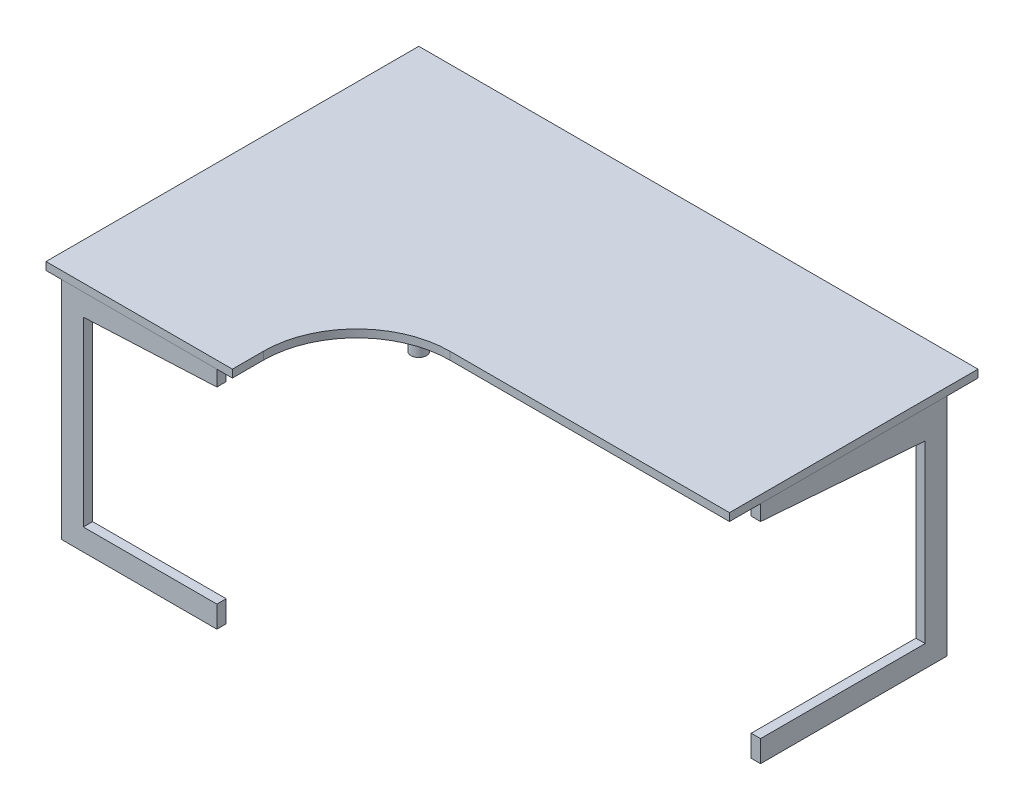
ISO-10303-21;
HEADER;
FILE_DESCRIPTION(('STEP AP214'),'2;1');
FILE_NAME('part.step','',(''),(''),'','','');
FILE_SCHEMA(('AUTOMOTIVE_DESIGN { 1 0 10303 214 1 1 1 1 }'));
ENDSEC;
DATA;
#1=APPLICATION_CONTEXT('core data for automotive mechanical design processes');
#2=APPLICATION_PROTOCOL_DEFINITION('international standard','automotive_design',2000,#1);
#3=PRODUCT_CONTEXT('',#1,'mechanical');
#4=PRODUCT('Part','Part','',(#3));
#5=PRODUCT_RELATED_PRODUCT_CATEGORY('part','',(#4));
#6=PRODUCT_DEFINITION_FORMATION('','',#4);
#7=PRODUCT_DEFINITION_CONTEXT('part definition',#1,'design');
#8=PRODUCT_DEFINITION('design','',#6,#7);
#9=PRODUCT_DEFINITION_SHAPE('','',#8);
#10=(LENGTH_UNIT() NAMED_UNIT(*) SI_UNIT(.MILLI.,.METRE.));
#11=(NAMED_UNIT(*) PLANE_ANGLE_UNIT() SI_UNIT($,.RADIAN.));
#12=(NAMED_UNIT(*) SI_UNIT($,.STERADIAN.) SOLID_ANGLE_UNIT());
#13=UNCERTAINTY_MEASURE_WITH_UNIT(LENGTH_MEASURE(1.E-05),#10,'distance_accuracy_value','');
#14=(GEOMETRIC_REPRESENTATION_CONTEXT(3) GLOBAL_UNCERTAINTY_ASSIGNED_CONTEXT((#13)) GLOBAL_UNIT_ASSIGNED_CONTEXT((#10,
#11,#12)) REPRESENTATION_CONTEXT('',''));
#15=CARTESIAN_POINT('',(0.,0.,0.));
#16=DIRECTION('',(0.,0.,1.));
#17=DIRECTION('',(1.,0.,0.));
#18=AXIS2_PLACEMENT_3D('',#15,#16,#17);
#19=CARTESIAN_POINT('',(-1250.,725.,1070.));
#20=DIRECTION('',(0.,1.,0.));
#21=DIRECTION('',(0.,0.,1.));
#22=AXIS2_PLACEMENT_3D('',#19,#20,#21);
#23=PLANE('',#22);
#24=DIRECTION('',(-1.,0.,0.));
#25=VECTOR('',#24,1.);
#26=CARTESIAN_POINT('',(-1250.,725.,1100.));
#27=LINE('',#26,#25);
#28=CARTESIAN_POINT('',(-1250.,725.,1100.));
#29=VERTEX_POINT('',#28);
#30=CARTESIAN_POINT('',(-1750.,725.,1100.));
#31=VERTEX_POINT('',#30);
#32=EDGE_CURVE('E142',#29,#31,#27,.T.);
#33=ORIENTED_EDGE('',*,*,#32,.F.);
#34=DIRECTION('',(0.,0.,1.));
#35=VECTOR('',#34,1.);
#36=CARTESIAN_POINT('',(-1250.,725.,1070.));
#37=LINE('',#36,#35);
#38=CARTESIAN_POINT('',(-1250.,725.,1070.));
#39=VERTEX_POINT('',#38);
#40=EDGE_CURVE('E12',#39,#29,#37,.T.);
#41=ORIENTED_EDGE('',*,*,#40,.F.);
#42=DIRECTION('',(-1.,0.,0.));
#43=VECTOR('',#42,1.);
#44=CARTESIAN_POINT('',(-1250.,725.,1070.));
#45=LINE('',#44,#43);
#46=CARTESIAN_POINT('',(-1750.,725.,1070.));
#47=VERTEX_POINT('',#46);
#48=EDGE_CURVE('E162',#39,#47,#45,.T.);
#49=ORIENTED_EDGE('',*,*,#48,.T.);
#50=DIRECTION('',(0.,0.,1.));
#51=VECTOR('',#50,1.);
#52=CARTESIAN_POINT('',(-1750.,725.,1070.));
#53=LINE('',#52,#51);
#54=EDGE_CURVE('E48',#47,#31,#53,.T.);
#55=ORIENTED_EDGE('',*,*,#54,.T.);
#56=EDGE_LOOP('',(#33,#41,#49,#55));
#57=FACE_BOUND('',#56,.T.);
#58=ADVANCED_FACE('F45',(#57),#23,.T.);
#59=CARTESIAN_POINT('',(-1250.,675.,1070.));
#60=DIRECTION('',(1.,0.,0.));
#61=DIRECTION('',(0.,1.,0.));
#62=AXIS2_PLACEMENT_3D('',#59,#60,#61);
#63=PLANE('',#62);
#64=DIRECTION('',(0.,1.,0.));
#65=VECTOR('',#64,1.);
#66=CARTESIAN_POINT('',(-1250.,675.,1100.));
#67=LINE('',#66,#65);
#68=CARTESIAN_POINT('',(-1250.,675.,1100.));
#69=VERTEX_POINT('',#68);
#70=EDGE_CURVE('E160',#69,#29,#67,.T.);
#71=ORIENTED_EDGE('',*,*,#70,.F.);
#72=DIRECTION('',(0.,0.,1.));
#73=VECTOR('',#72,1.);
#74=CARTESIAN_POINT('',(-1250.,675.,1070.));
#75=LINE('',#74,#73);
#76=CARTESIAN_POINT('',(-1250.,675.,1070.));
#77=VERTEX_POINT('',#76);
#78=EDGE_CURVE('E54',#77,#69,#75,.T.);
#79=ORIENTED_EDGE('',*,*,#78,.F.);
#80=DIRECTION('',(0.,1.,0.));
#81=VECTOR('',#80,1.);
#82=CARTESIAN_POINT('',(-1250.,675.,1070.));
#83=LINE('',#82,#81);
#84=EDGE_CURVE('E132',#77,#39,#83,.T.);
#85=ORIENTED_EDGE('',*,*,#84,.T.);
#86=ORIENTED_EDGE('',*,*,#40,.T.);
#87=EDGE_LOOP('',(#71,#79,#85,#86));
#88=FACE_BOUND('',#87,.T.);
#89=ADVANCED_FACE('F174',(#88),#63,.T.);
#90=CARTESIAN_POINT('',(-1680.,655.,1070.));
#91=DIRECTION('',(0.0464613993524679,-0.998920086078066,0.));
#92=DIRECTION('',(0.998920086078066,0.046461399352468,0.));
#93=AXIS2_PLACEMENT_3D('',#90,#91,#92);
#94=PLANE('',#93);
#95=DIRECTION('',(0.998920086078066,0.046461399352468,0.));
#96=VECTOR('',#95,1.);
#97=CARTESIAN_POINT('',(-1680.,655.,1100.));
#98=LINE('',#97,#96);
#99=CARTESIAN_POINT('',(-1680.,655.,1100.));
#100=VERTEX_POINT('',#99);
#101=EDGE_CURVE('E119',#100,#69,#98,.T.);
#102=ORIENTED_EDGE('',*,*,#101,.F.);
#103=DIRECTION('',(0.,0.,1.));
#104=VECTOR('',#103,1.);
#105=CARTESIAN_POINT('',(-1680.,655.,1070.));
#106=LINE('',#105,#104);
#107=CARTESIAN_POINT('',(-1680.,655.,1070.));
#108=VERTEX_POINT('',#107);
#109=EDGE_CURVE('E114',#108,#100,#106,.T.);
#110=ORIENTED_EDGE('',*,*,#109,.F.);
#111=DIRECTION('',(0.998920086078066,0.046461399352468,0.));
#112=VECTOR('',#111,1.);
#113=CARTESIAN_POINT('',(-1680.,655.,1070.));
#114=LINE('',#113,#112);
#115=EDGE_CURVE('E117',#108,#77,#114,.T.);
#116=ORIENTED_EDGE('',*,*,#115,.T.);
#117=ORIENTED_EDGE('',*,*,#78,.T.);
#118=EDGE_LOOP('',(#102,#110,#116,#117));
#119=FACE_BOUND('',#118,.T.);
#120=ADVANCED_FACE('F116',(#119),#94,.T.);
#121=CARTESIAN_POINT('',(-1680.,70.,1070.));
#122=DIRECTION('',(1.,0.,0.));
#123=DIRECTION('',(0.,1.,0.));
#124=AXIS2_PLACEMENT_3D('',#121,#122,#123);
#125=PLANE('',#124);
#126=DIRECTION('',(0.,1.,0.));
#127=VECTOR('',#126,1.);
#128=CARTESIAN_POINT('',(-1680.,70.,1100.));
#129=LINE('',#128,#127);
#130=CARTESIAN_POINT('',(-1680.,70.,1100.));
#131=VERTEX_POINT('',#130);
#132=EDGE_CURVE('E157',#131,#100,#129,.T.);
#133=ORIENTED_EDGE('',*,*,#132,.F.);
#134=DIRECTION('',(0.,0.,1.));
#135=VECTOR('',#134,1.);
#136=CARTESIAN_POINT('',(-1680.,70.,1070.));
#137=LINE('',#136,#135);
#138=CARTESIAN_POINT('',(-1680.,70.,1070.));
#139=VERTEX_POINT('',#138);
#140=EDGE_CURVE('E124',#139,#131,#137,.T.);
#141=ORIENTED_EDGE('',*,*,#140,.F.);
#142=DIRECTION('',(0.,1.,0.));
#143=VECTOR('',#142,1.);
#144=CARTESIAN_POINT('',(-1680.,70.,1070.));
#145=LINE('',#144,#143);
#146=EDGE_CURVE('E130',#139,#108,#145,.T.);
#147=ORIENTED_EDGE('',*,*,#146,.T.);
#148=ORIENTED_EDGE('',*,*,#109,.T.);
#149=EDGE_LOOP('',(#133,#141,#147,#148));
#150=FACE_BOUND('',#149,.T.);
#151=ADVANCED_FACE('F134',(#150),#125,.T.);
#152=CARTESIAN_POINT('',(-1250.,70.,1070.));
#153=DIRECTION('',(0.,1.,0.));
#154=DIRECTION('',(-1.,0.,0.));
#155=AXIS2_PLACEMENT_3D('',#152,#153,#154);
#156=PLANE('',#155);
#157=DIRECTION('',(-1.,0.,0.));
#158=VECTOR('',#157,1.);
#159=CARTESIAN_POINT('',(-1250.,70.,1100.));
#160=LINE('',#159,#158);
#161=CARTESIAN_POINT('',(-1250.,70.,1100.));
#162=VERTEX_POINT('',#161);
#163=EDGE_CURVE('E154',#162,#131,#160,.T.);
#164=ORIENTED_EDGE('',*,*,#163,.F.);
#165=DIRECTION('',(0.,0.,1.));
#166=VECTOR('',#165,1.);
#167=CARTESIAN_POINT('',(-1250.,70.,1070.));
#168=LINE('',#167,#166);
#169=CARTESIAN_POINT('',(-1250.,70.,1070.));
#170=VERTEX_POINT('',#169);
#171=EDGE_CURVE('E166',#170,#162,#168,.T.);
#172=ORIENTED_EDGE('',*,*,#171,.F.);
#173=DIRECTION('',(-1.,0.,0.));
#174=VECTOR('',#173,1.);
#175=CARTESIAN_POINT('',(-1250.,70.,1070.));
#176=LINE('',#175,#174);
#177=EDGE_CURVE('E135',#170,#139,#176,.T.);
#178=ORIENTED_EDGE('',*,*,#177,.T.);
#179=ORIENTED_EDGE('',*,*,#140,.T.);
#180=EDGE_LOOP('',(#164,#172,#178,#179));
#181=FACE_BOUND('',#180,.T.);
#182=ADVANCED_FACE('F187',(#181),#156,.T.);
#183=CARTESIAN_POINT('',(-1250.,0.,1070.));
#184=DIRECTION('',(1.,0.,0.));
#185=DIRECTION('',(0.,0.,-1.));
#186=AXIS2_PLACEMENT_3D('',#183,#184,#185);
#187=PLANE('',#186);
#188=DIRECTION('',(0.,1.,0.));
#189=VECTOR('',#188,1.);
#190=CARTESIAN_POINT('',(-1250.,0.,1100.));
#191=LINE('',#190,#189);
#192=CARTESIAN_POINT('',(-1250.,0.,1100.));
#193=VERTEX_POINT('',#192);
#194=EDGE_CURVE('E151',#193,#162,#191,.T.);
#195=ORIENTED_EDGE('',*,*,#194,.F.);
#196=DIRECTION('',(0.,0.,1.));
#197=VECTOR('',#196,1.);
#198=CARTESIAN_POINT('',(-1250.,0.,1070.));
#199=LINE('',#198,#197);
#200=CARTESIAN_POINT('',(-1250.,0.,1070.));
#201=VERTEX_POINT('',#200);
#202=EDGE_CURVE('E168',#201,#193,#199,.T.);
#203=ORIENTED_EDGE('',*,*,#202,.F.);
#204=DIRECTION('',(0.,1.,0.));
#205=VECTOR('',#204,1.);
#206=CARTESIAN_POINT('',(-1250.,0.,1070.));
#207=LINE('',#206,#205);
#208=EDGE_CURVE('E137',#201,#170,#207,.T.);
#209=ORIENTED_EDGE('',*,*,#208,.T.);
#210=ORIENTED_EDGE('',*,*,#171,.T.);
#211=EDGE_LOOP('',(#195,#203,#209,#210));
#212=FACE_BOUND('',#211,.T.);
#213=ADVANCED_FACE('F190',(#212),#187,.T.);
#214=CARTESIAN_POINT('',(-1750.,0.,1070.));
#215=DIRECTION('',(0.,-1.,0.));
#216=DIRECTION('',(1.,0.,0.));
#217=AXIS2_PLACEMENT_3D('',#214,#215,#216);
#218=PLANE('',#217);
#219=DIRECTION('',(1.,0.,0.));
#220=VECTOR('',#219,1.);
#221=CARTESIAN_POINT('',(-1750.,0.,1100.));
#222=LINE('',#221,#220);
#223=CARTESIAN_POINT('',(-1750.,0.,1100.));
#224=VERTEX_POINT('',#223);
#225=EDGE_CURVE('E148',#224,#193,#222,.T.);
#226=ORIENTED_EDGE('',*,*,#225,.F.);
#227=DIRECTION('',(0.,0.,1.));
#228=VECTOR('',#227,1.);
#229=CARTESIAN_POINT('',(-1750.,0.,1070.));
#230=LINE('',#229,#228);
#231=CARTESIAN_POINT('',(-1750.,0.,1070.));
#232=VERTEX_POINT('',#231);
#233=EDGE_CURVE('E169',#232,#224,#230,.T.);
#234=ORIENTED_EDGE('',*,*,#233,.F.);
#235=DIRECTION('',(1.,0.,0.));
#236=VECTOR('',#235,1.);
#237=CARTESIAN_POINT('',(-1750.,0.,1070.));
#238=LINE('',#237,#236);
#239=EDGE_CURVE('E265',#232,#201,#238,.T.);
#240=ORIENTED_EDGE('',*,*,#239,.T.);
#241=ORIENTED_EDGE('',*,*,#202,.T.);
#242=EDGE_LOOP('',(#226,#234,#240,#241));
#243=FACE_BOUND('',#242,.T.);
#244=ADVANCED_FACE('F194',(#243),#218,.T.);
#245=CARTESIAN_POINT('',(-1750.,725.,1070.));
#246=DIRECTION('',(-1.,0.,0.));
#247=DIRECTION('',(0.,-1.,0.));
#248=AXIS2_PLACEMENT_3D('',#245,#246,#247);
#249=PLANE('',#248);
#250=DIRECTION('',(0.,-1.,0.));
#251=VECTOR('',#250,1.);
#252=CARTESIAN_POINT('',(-1750.,725.,1100.));
#253=LINE('',#252,#251);
#254=EDGE_CURVE('E145',#31,#224,#253,.T.);
#255=ORIENTED_EDGE('',*,*,#254,.F.);
#256=ORIENTED_EDGE('',*,*,#54,.F.);
#257=DIRECTION('',(0.,-1.,0.));
#258=VECTOR('',#257,1.);
#259=CARTESIAN_POINT('',(-1750.,725.,1070.));
#260=LINE('',#259,#258);
#261=EDGE_CURVE('E266',#47,#232,#260,.T.);
#262=ORIENTED_EDGE('',*,*,#261,.T.);
#263=ORIENTED_EDGE('',*,*,#233,.T.);
#264=EDGE_LOOP('',(#255,#256,#262,#263));
#265=FACE_BOUND('',#264,.T.);
#266=ADVANCED_FACE('F171',(#265),#249,.T.);
#267=CARTESIAN_POINT('',(-1250.,725.,1070.));
#268=DIRECTION('',(0.,0.,-1.));
#269=DIRECTION('',(-1.,0.,0.));
#270=AXIS2_PLACEMENT_3D('',#267,#268,#269);
#271=PLANE('',#270);
#272=ORIENTED_EDGE('',*,*,#48,.F.);
#273=ORIENTED_EDGE('',*,*,#84,.F.);
#274=ORIENTED_EDGE('',*,*,#115,.F.);
#275=ORIENTED_EDGE('',*,*,#146,.F.);
#276=ORIENTED_EDGE('',*,*,#177,.F.);
#277=ORIENTED_EDGE('',*,*,#208,.F.);
#278=ORIENTED_EDGE('',*,*,#239,.F.);
#279=ORIENTED_EDGE('',*,*,#261,.F.);
#280=EDGE_LOOP('',(#272,#273,#274,#275,#276,#277,#278,#279));
#281=FACE_BOUND('',#280,.T.);
#282=ADVANCED_FACE('F128',(#281),#271,.T.);
#283=CARTESIAN_POINT('',(-1250.,725.,1100.));
#284=DIRECTION('',(0.,0.,-1.));
#285=DIRECTION('',(-1.,0.,0.));
#286=AXIS2_PLACEMENT_3D('',#283,#284,#285);
#287=PLANE('',#286);
#288=ORIENTED_EDGE('',*,*,#32,.T.);
#289=ORIENTED_EDGE('',*,*,#254,.T.);
#290=ORIENTED_EDGE('',*,*,#225,.T.);
#291=ORIENTED_EDGE('',*,*,#194,.T.);
#292=ORIENTED_EDGE('',*,*,#163,.T.);
#293=ORIENTED_EDGE('',*,*,#132,.T.);
#294=ORIENTED_EDGE('',*,*,#101,.T.);
#295=ORIENTED_EDGE('',*,*,#70,.T.);
#296=EDGE_LOOP('',(#288,#289,#290,#291,#292,#293,#294,#295));
#297=FACE_BOUND('',#296,.T.);
#298=ADVANCED_FACE('F173',(#297),#287,.F.);
#299=CLOSED_SHELL('',(#58,#89,#120,#151,#182,#213,#244,#266,#282,#298));
#300=MANIFOLD_SOLID_BREP('B2',#299);
#301=CARTESIAN_POINT('',(-900.,725.,1000.));
#302=DIRECTION('',(0.,1.,0.));
#303=DIRECTION('',(0.,0.,1.));
#304=AXIS2_PLACEMENT_3D('',#301,#302,#303);
#305=PLANE('',#304);
#306=DIRECTION('',(0.,0.,-1.));
#307=VECTOR('',#306,1.);
#308=CARTESIAN_POINT('',(0.,725.,-99.9999999999999));
#309=LINE('',#308,#307);
#310=CARTESIAN_POINT('',(0.,725.,700.));
#311=VERTEX_POINT('',#310);
#312=CARTESIAN_POINT('',(0.,725.,-99.9999999999999));
#313=VERTEX_POINT('',#312);
#314=EDGE_CURVE('E373',#311,#313,#309,.T.);
#315=ORIENTED_EDGE('',*,*,#314,.F.);
#316=DIRECTION('',(1.,0.,0.));
#317=VECTOR('',#316,1.);
#318=CARTESIAN_POINT('',(0.,725.,700.));
#319=LINE('',#318,#317);
#320=CARTESIAN_POINT('',(-900.,725.,700.));
#321=VERTEX_POINT('',#320);
#322=EDGE_CURVE('E330',#321,#311,#319,.T.);
#323=ORIENTED_EDGE('',*,*,#322,.F.);
#324=CARTESIAN_POINT('',(-900.,725.,1000.));
#325=DIRECTION('',(0.,-1.,0.));
#326=DIRECTION('',(0.,0.,1.));
#327=AXIS2_PLACEMENT_3D('',#324,#325,#326);
#328=CIRCLE('',#327,300.);
#329=CARTESIAN_POINT('',(-1200.,725.,1000.));
#330=VERTEX_POINT('',#329);
#331=EDGE_CURVE('E324',#330,#321,#328,.T.);
#332=ORIENTED_EDGE('',*,*,#331,.F.);
#333=DIRECTION('',(0.,0.,-1.));
#334=VECTOR('',#333,1.);
#335=CARTESIAN_POINT('',(-1200.,725.,1100.));
#336=LINE('',#335,#334);
#337=CARTESIAN_POINT('',(-1200.,725.,1100.));
#338=VERTEX_POINT('',#337);
#339=EDGE_CURVE('E363',#338,#330,#336,.T.);
#340=ORIENTED_EDGE('',*,*,#339,.F.);
#341=DIRECTION('',(1.,0.,0.));
#342=VECTOR('',#341,1.);
#343=CARTESIAN_POINT('',(-1800.,725.,1100.));
#344=LINE('',#343,#342);
#345=CARTESIAN_POINT('',(-1800.,725.,1100.));
#346=VERTEX_POINT('',#345);
#347=EDGE_CURVE('E381',#346,#338,#344,.T.);
#348=ORIENTED_EDGE('',*,*,#347,.F.);
#349=DIRECTION('',(0.,0.,1.));
#350=VECTOR('',#349,1.);
#351=CARTESIAN_POINT('',(-1800.,725.,-99.9999999999999));
#352=LINE('',#351,#350);
#353=CARTESIAN_POINT('',(-1800.,725.,-99.9999999999999));
#354=VERTEX_POINT('',#353);
#355=EDGE_CURVE('E379',#354,#346,#352,.T.);
#356=ORIENTED_EDGE('',*,*,#355,.F.);
#357=DIRECTION('',(-1.,0.,0.));
#358=VECTOR('',#357,1.);
#359=CARTESIAN_POINT('',(0.,725.,-99.9999999999999));
#360=LINE('',#359,#358);
#361=EDGE_CURVE('E376',#313,#354,#360,.T.);
#362=ORIENTED_EDGE('',*,*,#361,.F.);
#363=EDGE_LOOP('',(#315,#323,#332,#340,#348,#356,#362));
#364=FACE_BOUND('',#363,.T.);
#365=CARTESIAN_POINT('',(-1700.,725.,0.));
#366=DIRECTION('',(0.,1.,0.));
#367=DIRECTION('',(0.,0.,1.));
#368=AXIS2_PLACEMENT_3D('',#365,#366,#367);
#369=CIRCLE('',#368,25.);
#370=CARTESIAN_POINT('',(-1700.,725.,25.));
#371=VERTEX_POINT('',#370);
#372=EDGE_CURVE('E43',#371,#371,#369,.F.);
#373=ORIENTED_EDGE('',*,*,#372,.F.);
#374=EDGE_LOOP('',(#373));
#375=FACE_BOUND('',#374,.T.);
#376=ADVANCED_FACE('F281',(#364,#375),#305,.F.);
#377=CARTESIAN_POINT('',(0.,750.,-99.9999999999999));
#378=DIRECTION('',(-1.,0.,0.));
#379=DIRECTION('',(0.,0.,1.));
#380=AXIS2_PLACEMENT_3D('',#377,#378,#379);
#381=PLANE('',#380);
#382=ORIENTED_EDGE('',*,*,#314,.T.);
#383=DIRECTION('',(0.,-1.,0.));
#384=VECTOR('',#383,1.);
#385=CARTESIAN_POINT('',(0.,750.,-99.9999999999999));
#386=LINE('',#385,#384);
#387=CARTESIAN_POINT('',(0.,750.,-99.9999999999999));
#388=VERTEX_POINT('',#387);
#389=EDGE_CURVE('E290',#388,#313,#386,.T.);
#390=ORIENTED_EDGE('',*,*,#389,.F.);
#391=DIRECTION('',(0.,0.,-1.));
#392=VECTOR('',#391,1.);
#393=CARTESIAN_POINT('',(0.,750.,-99.9999999999999));
#394=LINE('',#393,#392);
#395=CARTESIAN_POINT('',(0.,750.,700.));
#396=VERTEX_POINT('',#395);
#397=EDGE_CURVE('E386',#396,#388,#394,.T.);
#398=ORIENTED_EDGE('',*,*,#397,.F.);
#399=DIRECTION('',(0.,-1.,0.));
#400=VECTOR('',#399,1.);
#401=CARTESIAN_POINT('',(0.,750.,700.));
#402=LINE('',#401,#400);
#403=EDGE_CURVE('E369',#396,#311,#402,.T.);
#404=ORIENTED_EDGE('',*,*,#403,.T.);
#405=EDGE_LOOP('',(#382,#390,#398,#404));
#406=FACE_BOUND('',#405,.T.);
#407=ADVANCED_FACE('F283',(#406),#381,.F.);
#408=CARTESIAN_POINT('',(0.,750.,-99.9999999999999));
#409=DIRECTION('',(0.,0.,1.));
#410=DIRECTION('',(1.,0.,0.));
#411=AXIS2_PLACEMENT_3D('',#408,#409,#410);
#412=PLANE('',#411);
#413=ORIENTED_EDGE('',*,*,#361,.T.);
#414=DIRECTION('',(0.,-1.,0.));
#415=VECTOR('',#414,1.);
#416=CARTESIAN_POINT('',(-1800.,750.,-99.9999999999999));
#417=LINE('',#416,#415);
#418=CARTESIAN_POINT('',(-1800.,750.,-99.9999999999999));
#419=VERTEX_POINT('',#418);
#420=EDGE_CURVE('E393',#419,#354,#417,.T.);
#421=ORIENTED_EDGE('',*,*,#420,.F.);
#422=DIRECTION('',(-1.,0.,0.));
#423=VECTOR('',#422,1.);
#424=CARTESIAN_POINT('',(0.,750.,-99.9999999999999));
#425=LINE('',#424,#423);
#426=EDGE_CURVE('E339',#388,#419,#425,.T.);
#427=ORIENTED_EDGE('',*,*,#426,.F.);
#428=ORIENTED_EDGE('',*,*,#389,.T.);
#429=EDGE_LOOP('',(#413,#421,#427,#428));
#430=FACE_BOUND('',#429,.T.);
#431=ADVANCED_FACE('F396',(#430),#412,.F.);
#432=CARTESIAN_POINT('',(-1800.,750.,-99.9999999999999));
#433=DIRECTION('',(1.,0.,0.));
#434=DIRECTION('',(0.,0.,-1.));
#435=AXIS2_PLACEMENT_3D('',#432,#433,#434);
#436=PLANE('',#435);
#437=ORIENTED_EDGE('',*,*,#355,.T.);
#438=DIRECTION('',(0.,-1.,0.));
#439=VECTOR('',#438,1.);
#440=CARTESIAN_POINT('',(-1800.,750.,1100.));
#441=LINE('',#440,#439);
#442=CARTESIAN_POINT('',(-1800.,750.,1100.));
#443=VERTEX_POINT('',#442);
#444=EDGE_CURVE('E390',#443,#346,#441,.T.);
#445=ORIENTED_EDGE('',*,*,#444,.F.);
#446=DIRECTION('',(0.,0.,1.));
#447=VECTOR('',#446,1.);
#448=CARTESIAN_POINT('',(-1800.,750.,-99.9999999999999));
#449=LINE('',#448,#447);
#450=EDGE_CURVE('E410',#419,#443,#449,.T.);
#451=ORIENTED_EDGE('',*,*,#450,.F.);
#452=ORIENTED_EDGE('',*,*,#420,.T.);
#453=EDGE_LOOP('',(#437,#445,#451,#452));
#454=FACE_BOUND('',#453,.T.);
#455=ADVANCED_FACE('F406',(#454),#436,.F.);
#456=CARTESIAN_POINT('',(-1800.,750.,1100.));
#457=DIRECTION('',(0.,0.,-1.));
#458=DIRECTION('',(-1.,0.,0.));
#459=AXIS2_PLACEMENT_3D('',#456,#457,#458);
#460=PLANE('',#459);
#461=ORIENTED_EDGE('',*,*,#347,.T.);
#462=DIRECTION('',(0.,-1.,0.));
#463=VECTOR('',#462,1.);
#464=CARTESIAN_POINT('',(-1200.,750.,1100.));
#465=LINE('',#464,#463);
#466=CARTESIAN_POINT('',(-1200.,750.,1100.));
#467=VERTEX_POINT('',#466);
#468=EDGE_CURVE('E364',#467,#338,#465,.T.);
#469=ORIENTED_EDGE('',*,*,#468,.F.);
#470=DIRECTION('',(1.,0.,0.));
#471=VECTOR('',#470,1.);
#472=CARTESIAN_POINT('',(-1800.,750.,1100.));
#473=LINE('',#472,#471);
#474=EDGE_CURVE('E355',#443,#467,#473,.T.);
#475=ORIENTED_EDGE('',*,*,#474,.F.);
#476=ORIENTED_EDGE('',*,*,#444,.T.);
#477=EDGE_LOOP('',(#461,#469,#475,#476));
#478=FACE_BOUND('',#477,.T.);
#479=ADVANCED_FACE('F409',(#478),#460,.F.);
#480=CARTESIAN_POINT('',(-1200.,750.,1100.));
#481=DIRECTION('',(-1.,0.,0.));
#482=DIRECTION('',(0.,0.,1.));
#483=AXIS2_PLACEMENT_3D('',#480,#481,#482);
#484=PLANE('',#483);
#485=ORIENTED_EDGE('',*,*,#339,.T.);
#486=DIRECTION('',(0.,-1.,0.));
#487=VECTOR('',#486,1.);
#488=CARTESIAN_POINT('',(-1200.,750.,1000.));
#489=LINE('',#488,#487);
#490=CARTESIAN_POINT('',(-1200.,750.,1000.));
#491=VERTEX_POINT('',#490);
#492=EDGE_CURVE('E360',#491,#330,#489,.T.);
#493=ORIENTED_EDGE('',*,*,#492,.F.);
#494=DIRECTION('',(0.,0.,-1.));
#495=VECTOR('',#494,1.);
#496=CARTESIAN_POINT('',(-1200.,750.,1100.));
#497=LINE('',#496,#495);
#498=EDGE_CURVE('E349',#467,#491,#497,.T.);
#499=ORIENTED_EDGE('',*,*,#498,.F.);
#500=ORIENTED_EDGE('',*,*,#468,.T.);
#501=EDGE_LOOP('',(#485,#493,#499,#500));
#502=FACE_BOUND('',#501,.T.);
#503=ADVANCED_FACE('F361',(#502),#484,.F.);
#504=CARTESIAN_POINT('',(-900.,750.,1000.));
#505=DIRECTION('',(0.,-1.,0.));
#506=DIRECTION('',(0.,0.,-1.));
#507=AXIS2_PLACEMENT_3D('',#504,#505,#506);
#508=CYLINDRICAL_SURFACE('',#507,300.);
#509=ORIENTED_EDGE('',*,*,#331,.T.);
#510=DIRECTION('',(0.,-1.,0.));
#511=VECTOR('',#510,1.);
#512=CARTESIAN_POINT('',(-900.,750.,700.));
#513=LINE('',#512,#511);
#514=CARTESIAN_POINT('',(-900.,750.,700.));
#515=VERTEX_POINT('',#514);
#516=EDGE_CURVE('E365',#515,#321,#513,.T.);
#517=ORIENTED_EDGE('',*,*,#516,.F.);
#518=CARTESIAN_POINT('',(-900.,750.,1000.));
#519=DIRECTION('',(0.,-1.,0.));
#520=DIRECTION('',(0.,0.,1.));
#521=AXIS2_PLACEMENT_3D('',#518,#519,#520);
#522=CIRCLE('',#521,300.);
#523=EDGE_CURVE('E353',#491,#515,#522,.T.);
#524=ORIENTED_EDGE('',*,*,#523,.F.);
#525=ORIENTED_EDGE('',*,*,#492,.T.);
#526=EDGE_LOOP('',(#509,#517,#524,#525));
#527=FACE_BOUND('',#526,.T.);
#528=ADVANCED_FACE('F367',(#527),#508,.F.);
#529=CARTESIAN_POINT('',(0.,750.,700.));
#530=DIRECTION('',(0.,0.,-1.));
#531=DIRECTION('',(-1.,0.,0.));
#532=AXIS2_PLACEMENT_3D('',#529,#530,#531);
#533=PLANE('',#532);
#534=ORIENTED_EDGE('',*,*,#322,.T.);
#535=ORIENTED_EDGE('',*,*,#403,.F.);
#536=DIRECTION('',(1.,0.,0.));
#537=VECTOR('',#536,1.);
#538=CARTESIAN_POINT('',(0.,750.,700.));
#539=LINE('',#538,#537);
#540=EDGE_CURVE('E298',#515,#396,#539,.T.);
#541=ORIENTED_EDGE('',*,*,#540,.F.);
#542=ORIENTED_EDGE('',*,*,#516,.T.);
#543=EDGE_LOOP('',(#534,#535,#541,#542));
#544=FACE_BOUND('',#543,.T.);
#545=ADVANCED_FACE('F435',(#544),#533,.F.);
#546=CARTESIAN_POINT('',(-900.,750.,1000.));
#547=DIRECTION('',(0.,1.,0.));
#548=DIRECTION('',(0.,0.,1.));
#549=AXIS2_PLACEMENT_3D('',#546,#547,#548);
#550=PLANE('',#549);
#551=ORIENTED_EDGE('',*,*,#397,.T.);
#552=ORIENTED_EDGE('',*,*,#426,.T.);
#553=ORIENTED_EDGE('',*,*,#450,.T.);
#554=ORIENTED_EDGE('',*,*,#474,.T.);
#555=ORIENTED_EDGE('',*,*,#498,.T.);
#556=ORIENTED_EDGE('',*,*,#523,.T.);
#557=ORIENTED_EDGE('',*,*,#540,.T.);
#558=EDGE_LOOP('',(#551,#552,#553,#554,#555,#556,#557));
#559=FACE_BOUND('',#558,.T.);
#560=ADVANCED_FACE('F351',(#559),#550,.T.);
#561=CARTESIAN_POINT('',(-1700.,795.710678118655,0.));
#562=DIRECTION('',(0.,-1.,0.));
#563=DIRECTION('',(0.,0.,-1.));
#564=AXIS2_PLACEMENT_3D('',#561,#562,#563);
#565=CYLINDRICAL_SURFACE('',#564,25.);
#566=CARTESIAN_POINT('',(-1700.,0.,0.));
#567=DIRECTION('',(0.,1.,0.));
#568=DIRECTION('',(0.,0.,1.));
#569=AXIS2_PLACEMENT_3D('',#566,#567,#568);
#570=CIRCLE('',#569,25.);
#571=CARTESIAN_POINT('',(-1700.,0.,25.));
#572=VERTEX_POINT('',#571);
#573=EDGE_CURVE('E377',#572,#572,#570,.T.);
#574=ORIENTED_EDGE('',*,*,#573,.T.);
#575=EDGE_LOOP('',(#574));
#576=FACE_BOUND('',#575,.T.);
#577=ORIENTED_EDGE('',*,*,#372,.T.);
#578=EDGE_LOOP('',(#577));
#579=FACE_BOUND('',#578,.T.);
#580=ADVANCED_FACE('F418',(#576,#579),#565,.T.);
#581=CARTESIAN_POINT('',(-1700.,0.,0.));
#582=DIRECTION('',(0.,1.,0.));
#583=DIRECTION('',(0.,0.,1.));
#584=AXIS2_PLACEMENT_3D('',#581,#582,#583);
#585=PLANE('',#584);
#586=ORIENTED_EDGE('',*,*,#573,.F.);
#587=EDGE_LOOP('',(#586));
#588=FACE_BOUND('',#587,.T.);
#589=ADVANCED_FACE('F421',(#588),#585,.F.);
#590=CLOSED_SHELL('',(#376,#407,#431,#455,#479,#503,#528,#545,#560,#580,#589));
#591=MANIFOLD_SOLID_BREP('B6',#590);
#592=CARTESIAN_POINT('',(-30.,725.,0.));
#593=DIRECTION('',(0.,0.,-1.));
#594=DIRECTION('',(0.,1.,0.));
#595=AXIS2_PLACEMENT_3D('',#592,#593,#594);
#596=PLANE('',#595);
#597=DIRECTION('',(0.,1.,0.));
#598=VECTOR('',#597,1.);
#599=CARTESIAN_POINT('',(0.,725.,0.));
#600=LINE('',#599,#598);
#601=CARTESIAN_POINT('',(0.,0.,0.));
#602=VERTEX_POINT('',#601);
#603=CARTESIAN_POINT('',(0.,725.,0.));
#604=VERTEX_POINT('',#603);
#605=EDGE_CURVE('E609',#602,#604,#600,.T.);
#606=ORIENTED_EDGE('',*,*,#605,.F.);
#607=DIRECTION('',(1.,0.,0.));
#608=VECTOR('',#607,1.);
#609=CARTESIAN_POINT('',(-30.,0.,0.));
#610=LINE('',#609,#608);
#611=CARTESIAN_POINT('',(-30.,0.,0.));
#612=VERTEX_POINT('',#611);
#613=EDGE_CURVE('E279',#612,#602,#610,.T.);
#614=ORIENTED_EDGE('',*,*,#613,.F.);
#615=DIRECTION('',(0.,1.,0.));
#616=VECTOR('',#615,1.);
#617=CARTESIAN_POINT('',(-30.,725.,0.));
#618=LINE('',#617,#616);
#619=CARTESIAN_POINT('',(-30.,725.,0.));
#620=VERTEX_POINT('',#619);
#621=EDGE_CURVE('E629',#612,#620,#618,.T.);
#622=ORIENTED_EDGE('',*,*,#621,.T.);
#623=DIRECTION('',(1.,0.,0.));
#624=VECTOR('',#623,1.);
#625=CARTESIAN_POINT('',(-30.,725.,0.));
#626=LINE('',#625,#624);
#627=EDGE_CURVE('E515',#620,#604,#626,.T.);
#628=ORIENTED_EDGE('',*,*,#627,.T.);
#629=EDGE_LOOP('',(#606,#614,#622,#628));
#630=FACE_BOUND('',#629,.T.);
#631=ADVANCED_FACE('F512',(#630),#596,.T.);
#632=CARTESIAN_POINT('',(-30.,0.,0.));
#633=DIRECTION('',(0.,-1.,0.));
#634=DIRECTION('',(0.,0.,-1.));
#635=AXIS2_PLACEMENT_3D('',#632,#633,#634);
#636=PLANE('',#635);
#637=DIRECTION('',(0.,0.,-1.));
#638=VECTOR('',#637,1.);
#639=CARTESIAN_POINT('',(0.,0.,0.));
#640=LINE('',#639,#638);
#641=CARTESIAN_POINT('',(0.,0.,600.));
#642=VERTEX_POINT('',#641);
#643=EDGE_CURVE('E627',#642,#602,#640,.T.);
#644=ORIENTED_EDGE('',*,*,#643,.F.);
#645=DIRECTION('',(1.,0.,0.));
#646=VECTOR('',#645,1.);
#647=CARTESIAN_POINT('',(-30.,0.,600.));
#648=LINE('',#647,#646);
#649=CARTESIAN_POINT('',(-30.,0.,600.));
#650=VERTEX_POINT('',#649);
#651=EDGE_CURVE('E521',#650,#642,#648,.T.);
#652=ORIENTED_EDGE('',*,*,#651,.F.);
#653=DIRECTION('',(0.,0.,-1.));
#654=VECTOR('',#653,1.);
#655=CARTESIAN_POINT('',(-30.,0.,0.));
#656=LINE('',#655,#654);
#657=EDGE_CURVE('E599',#650,#612,#656,.T.);
#658=ORIENTED_EDGE('',*,*,#657,.T.);
#659=ORIENTED_EDGE('',*,*,#613,.T.);
#660=EDGE_LOOP('',(#644,#652,#658,#659));
#661=FACE_BOUND('',#660,.T.);
#662=ADVANCED_FACE('F641',(#661),#636,.T.);
#663=CARTESIAN_POINT('',(-30.,0.,600.));
#664=DIRECTION('',(0.,0.,1.));
#665=DIRECTION('',(1.,0.,0.));
#666=AXIS2_PLACEMENT_3D('',#663,#664,#665);
#667=PLANE('',#666);
#668=DIRECTION('',(0.,-1.,0.));
#669=VECTOR('',#668,1.);
#670=CARTESIAN_POINT('',(0.,0.,600.));
#671=LINE('',#670,#669);
#672=CARTESIAN_POINT('',(0.,69.9999999999999,600.));
#673=VERTEX_POINT('',#672);
#674=EDGE_CURVE('E586',#673,#642,#671,.T.);
#675=ORIENTED_EDGE('',*,*,#674,.F.);
#676=DIRECTION('',(1.,0.,0.));
#677=VECTOR('',#676,1.);
#678=CARTESIAN_POINT('',(-30.,69.9999999999999,600.));
#679=LINE('',#678,#677);
#680=CARTESIAN_POINT('',(-30.,69.9999999999999,600.));
#681=VERTEX_POINT('',#680);
#682=EDGE_CURVE('E581',#681,#673,#679,.T.);
#683=ORIENTED_EDGE('',*,*,#682,.F.);
#684=DIRECTION('',(0.,-1.,0.));
#685=VECTOR('',#684,1.);
#686=CARTESIAN_POINT('',(-30.,0.,600.));
#687=LINE('',#686,#685);
#688=EDGE_CURVE('E584',#681,#650,#687,.T.);
#689=ORIENTED_EDGE('',*,*,#688,.T.);
#690=ORIENTED_EDGE('',*,*,#651,.T.);
#691=EDGE_LOOP('',(#675,#683,#689,#690));
#692=FACE_BOUND('',#691,.T.);
#693=ADVANCED_FACE('F583',(#692),#667,.T.);
#694=CARTESIAN_POINT('',(-30.,69.9999999999999,600.));
#695=DIRECTION('',(0.,1.,0.));
#696=DIRECTION('',(0.,0.,1.));
#697=AXIS2_PLACEMENT_3D('',#694,#695,#696);
#698=PLANE('',#697);
#699=DIRECTION('',(0.,0.,1.));
#700=VECTOR('',#699,1.);
#701=CARTESIAN_POINT('',(0.,69.9999999999999,600.));
#702=LINE('',#701,#700);
#703=CARTESIAN_POINT('',(0.,69.9999999999999,70.));
#704=VERTEX_POINT('',#703);
#705=EDGE_CURVE('E624',#704,#673,#702,.T.);
#706=ORIENTED_EDGE('',*,*,#705,.F.);
#707=DIRECTION('',(1.,0.,0.));
#708=VECTOR('',#707,1.);
#709=CARTESIAN_POINT('',(-30.,69.9999999999999,70.));
#710=LINE('',#709,#708);
#711=CARTESIAN_POINT('',(-30.,69.9999999999999,70.));
#712=VERTEX_POINT('',#711);
#713=EDGE_CURVE('E591',#712,#704,#710,.T.);
#714=ORIENTED_EDGE('',*,*,#713,.F.);
#715=DIRECTION('',(0.,0.,1.));
#716=VECTOR('',#715,1.);
#717=CARTESIAN_POINT('',(-30.,69.9999999999999,600.));
#718=LINE('',#717,#716);
#719=EDGE_CURVE('E597',#712,#681,#718,.T.);
#720=ORIENTED_EDGE('',*,*,#719,.T.);
#721=ORIENTED_EDGE('',*,*,#682,.T.);
#722=EDGE_LOOP('',(#706,#714,#720,#721));
#723=FACE_BOUND('',#722,.T.);
#724=ADVANCED_FACE('F601',(#723),#698,.T.);
#725=CARTESIAN_POINT('',(-30.,69.9999999999999,70.));
#726=DIRECTION('',(0.,0.,1.));
#727=DIRECTION('',(1.,0.,0.));
#728=AXIS2_PLACEMENT_3D('',#725,#726,#727);
#729=PLANE('',#728);
#730=DIRECTION('',(0.,-1.,0.));
#731=VECTOR('',#730,1.);
#732=CARTESIAN_POINT('',(0.,69.9999999999999,70.));
#733=LINE('',#732,#731);
#734=CARTESIAN_POINT('',(0.,635.,70.));
#735=VERTEX_POINT('',#734);
#736=EDGE_CURVE('E621',#735,#704,#733,.T.);
#737=ORIENTED_EDGE('',*,*,#736,.F.);
#738=DIRECTION('',(1.,0.,0.));
#739=VECTOR('',#738,1.);
#740=CARTESIAN_POINT('',(-30.,635.,70.));
#741=LINE('',#740,#739);
#742=CARTESIAN_POINT('',(-30.,635.,70.));
#743=VERTEX_POINT('',#742);
#744=EDGE_CURVE('E633',#743,#735,#741,.T.);
#745=ORIENTED_EDGE('',*,*,#744,.F.);
#746=DIRECTION('',(0.,-1.,0.));
#747=VECTOR('',#746,1.);
#748=CARTESIAN_POINT('',(-30.,69.9999999999999,70.));
#749=LINE('',#748,#747);
#750=EDGE_CURVE('E602',#743,#712,#749,.T.);
#751=ORIENTED_EDGE('',*,*,#750,.T.);
#752=ORIENTED_EDGE('',*,*,#713,.T.);
#753=EDGE_LOOP('',(#737,#745,#751,#752));
#754=FACE_BOUND('',#753,.T.);
#755=ADVANCED_FACE('F654',(#754),#729,.T.);
#756=CARTESIAN_POINT('',(-30.,635.,70.));
#757=DIRECTION('',(0.,-0.997164120486613,0.0752576694706876));
#758=DIRECTION('',(0.,-0.0752576694706876,-0.997164120486613));
#759=AXIS2_PLACEMENT_3D('',#756,#757,#758);
#760=PLANE('',#759);
#761=DIRECTION('',(0.,-0.0752576694706876,-0.997164120486613));
#762=VECTOR('',#761,1.);
#763=CARTESIAN_POINT('',(0.,635.,70.));
#764=LINE('',#763,#762);
#765=CARTESIAN_POINT('',(0.,675.,600.));
#766=VERTEX_POINT('',#765);
#767=EDGE_CURVE('E618',#766,#735,#764,.T.);
#768=ORIENTED_EDGE('',*,*,#767,.F.);
#769=DIRECTION('',(1.,0.,0.));
#770=VECTOR('',#769,1.);
#771=CARTESIAN_POINT('',(-30.,675.,600.));
#772=LINE('',#771,#770);
#773=CARTESIAN_POINT('',(-30.,675.,600.));
#774=VERTEX_POINT('',#773);
#775=EDGE_CURVE('E635',#774,#766,#772,.T.);
#776=ORIENTED_EDGE('',*,*,#775,.F.);
#777=DIRECTION('',(0.,-0.0752576694706876,-0.997164120486613));
#778=VECTOR('',#777,1.);
#779=CARTESIAN_POINT('',(-30.,635.,70.));
#780=LINE('',#779,#778);
#781=EDGE_CURVE('E604',#774,#743,#780,.T.);
#782=ORIENTED_EDGE('',*,*,#781,.T.);
#783=ORIENTED_EDGE('',*,*,#744,.T.);
#784=EDGE_LOOP('',(#768,#776,#782,#783));
#785=FACE_BOUND('',#784,.T.);
#786=ADVANCED_FACE('F657',(#785),#760,.T.);
#787=CARTESIAN_POINT('',(-30.,675.,600.));
#788=DIRECTION('',(0.,0.,1.));
#789=DIRECTION('',(1.,0.,0.));
#790=AXIS2_PLACEMENT_3D('',#787,#788,#789);
#791=PLANE('',#790);
#792=DIRECTION('',(0.,-1.,0.));
#793=VECTOR('',#792,1.);
#794=CARTESIAN_POINT('',(0.,675.,600.));
#795=LINE('',#794,#793);
#796=CARTESIAN_POINT('',(0.,725.,600.));
#797=VERTEX_POINT('',#796);
#798=EDGE_CURVE('E615',#797,#766,#795,.T.);
#799=ORIENTED_EDGE('',*,*,#798,.F.);
#800=DIRECTION('',(1.,0.,0.));
#801=VECTOR('',#800,1.);
#802=CARTESIAN_POINT('',(-30.,725.,600.));
#803=LINE('',#802,#801);
#804=CARTESIAN_POINT('',(-30.,725.,600.));
#805=VERTEX_POINT('',#804);
#806=EDGE_CURVE('E636',#805,#797,#803,.T.);
#807=ORIENTED_EDGE('',*,*,#806,.F.);
#808=DIRECTION('',(0.,-1.,0.));
#809=VECTOR('',#808,1.);
#810=CARTESIAN_POINT('',(-30.,675.,600.));
#811=LINE('',#810,#809);
#812=EDGE_CURVE('E732',#805,#774,#811,.T.);
#813=ORIENTED_EDGE('',*,*,#812,.T.);
#814=ORIENTED_EDGE('',*,*,#775,.T.);
#815=EDGE_LOOP('',(#799,#807,#813,#814));
#816=FACE_BOUND('',#815,.T.);
#817=ADVANCED_FACE('F661',(#816),#791,.T.);
#818=CARTESIAN_POINT('',(-30.,725.,600.));
#819=DIRECTION('',(0.,1.,0.));
#820=DIRECTION('',(0.,0.,1.));
#821=AXIS2_PLACEMENT_3D('',#818,#819,#820);
#822=PLANE('',#821);
#823=DIRECTION('',(0.,0.,1.));
#824=VECTOR('',#823,1.);
#825=CARTESIAN_POINT('',(0.,725.,600.));
#826=LINE('',#825,#824);
#827=EDGE_CURVE('E612',#604,#797,#826,.T.);
#828=ORIENTED_EDGE('',*,*,#827,.F.);
#829=ORIENTED_EDGE('',*,*,#627,.F.);
#830=DIRECTION('',(0.,0.,1.));
#831=VECTOR('',#830,1.);
#832=CARTESIAN_POINT('',(-30.,725.,600.));
#833=LINE('',#832,#831);
#834=EDGE_CURVE('E733',#620,#805,#833,.T.);
#835=ORIENTED_EDGE('',*,*,#834,.T.);
#836=ORIENTED_EDGE('',*,*,#806,.T.);
#837=EDGE_LOOP('',(#828,#829,#835,#836));
#838=FACE_BOUND('',#837,.T.);
#839=ADVANCED_FACE('F638',(#838),#822,.T.);
#840=CARTESIAN_POINT('',(-30.,69.9999999999999,0.));
#841=DIRECTION('',(1.,0.,0.));
#842=DIRECTION('',(0.,0.,-1.));
#843=AXIS2_PLACEMENT_3D('',#840,#841,#842);
#844=PLANE('',#843);
#845=ORIENTED_EDGE('',*,*,#621,.F.);
#846=ORIENTED_EDGE('',*,*,#657,.F.);
#847=ORIENTED_EDGE('',*,*,#688,.F.);
#848=ORIENTED_EDGE('',*,*,#719,.F.);
#849=ORIENTED_EDGE('',*,*,#750,.F.);
#850=ORIENTED_EDGE('',*,*,#781,.F.);
#851=ORIENTED_EDGE('',*,*,#812,.F.);
#852=ORIENTED_EDGE('',*,*,#834,.F.);
#853=EDGE_LOOP('',(#845,#846,#847,#848,#849,#850,#851,#852));
#854=FACE_BOUND('',#853,.T.);
#855=ADVANCED_FACE('F595',(#854),#844,.F.);
#856=CARTESIAN_POINT('',(0.,69.9999999999999,0.));
#857=DIRECTION('',(1.,0.,0.));
#858=DIRECTION('',(0.,0.,-1.));
#859=AXIS2_PLACEMENT_3D('',#856,#857,#858);
#860=PLANE('',#859);
#861=ORIENTED_EDGE('',*,*,#605,.T.);
#862=ORIENTED_EDGE('',*,*,#827,.T.);
#863=ORIENTED_EDGE('',*,*,#798,.T.);
#864=ORIENTED_EDGE('',*,*,#767,.T.);
#865=ORIENTED_EDGE('',*,*,#736,.T.);
#866=ORIENTED_EDGE('',*,*,#705,.T.);
#867=ORIENTED_EDGE('',*,*,#674,.T.);
#868=ORIENTED_EDGE('',*,*,#643,.T.);
#869=EDGE_LOOP('',(#861,#862,#863,#864,#865,#866,#867,#868));
#870=FACE_BOUND('',#869,.T.);
#871=ADVANCED_FACE('F640',(#870),#860,.T.);
#872=CLOSED_SHELL('',(#631,#662,#693,#724,#755,#786,#817,#839,#855,#871));
#873=MANIFOLD_SOLID_BREP('B37',#872);
#874=ADVANCED_BREP_SHAPE_REPRESENTATION('',(#18,#300,#591,#873),#14);
#875=SHAPE_DEFINITION_REPRESENTATION(#9,#874);
ENDSEC;
END-ISO-10303-21;
